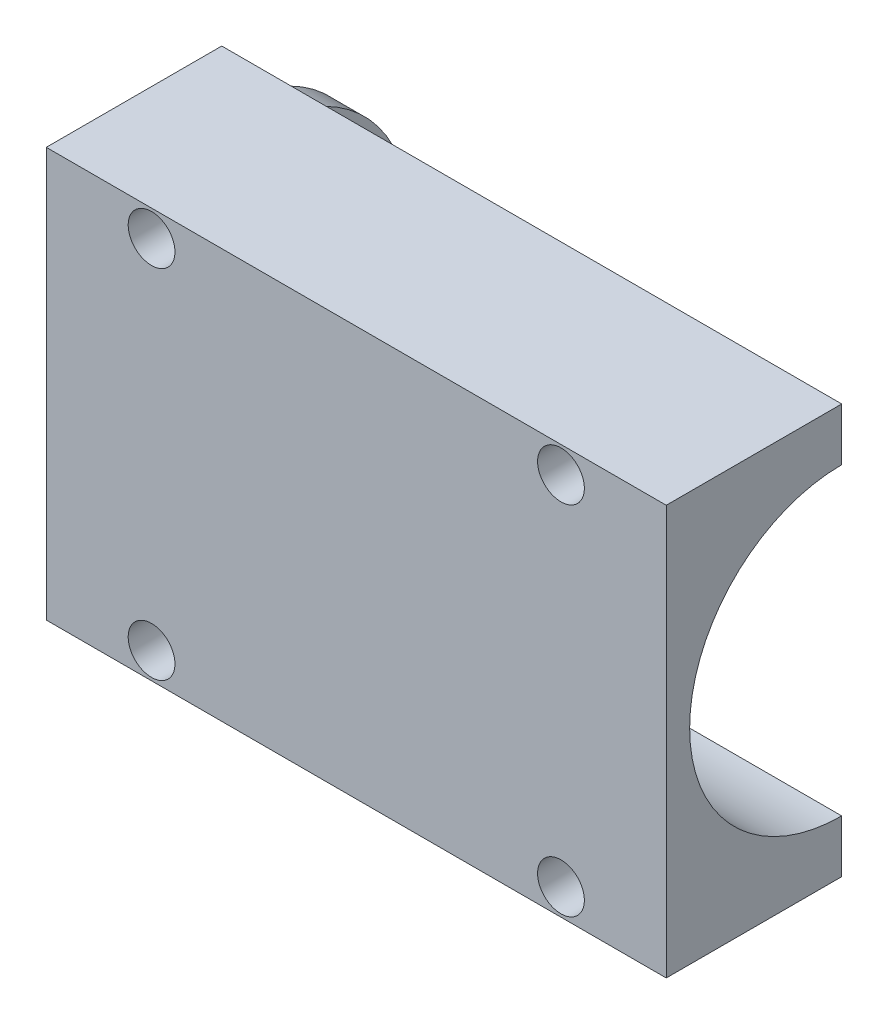
ISO-10303-21;
HEADER;
FILE_DESCRIPTION(('STEP AP214'),'2;1');
FILE_NAME('part.step','',(''),(''),'','','');
FILE_SCHEMA(('AUTOMOTIVE_DESIGN { 1 0 10303 214 1 1 1 1 }'));
ENDSEC;
DATA;
#1=APPLICATION_CONTEXT('core data for automotive mechanical design processes');
#2=APPLICATION_PROTOCOL_DEFINITION('international standard','automotive_design',2000,#1);
#3=PRODUCT_CONTEXT('',#1,'mechanical');
#4=PRODUCT('Part','Part','',(#3));
#5=PRODUCT_RELATED_PRODUCT_CATEGORY('part','',(#4));
#6=PRODUCT_DEFINITION_FORMATION('','',#4);
#7=PRODUCT_DEFINITION_CONTEXT('part definition',#1,'design');
#8=PRODUCT_DEFINITION('design','',#6,#7);
#9=PRODUCT_DEFINITION_SHAPE('','',#8);
#10=(LENGTH_UNIT() NAMED_UNIT(*) SI_UNIT(.MILLI.,.METRE.));
#11=(NAMED_UNIT(*) PLANE_ANGLE_UNIT() SI_UNIT($,.RADIAN.));
#12=(NAMED_UNIT(*) SI_UNIT($,.STERADIAN.) SOLID_ANGLE_UNIT());
#13=UNCERTAINTY_MEASURE_WITH_UNIT(LENGTH_MEASURE(1.E-05),#10,'distance_accuracy_value','');
#14=(GEOMETRIC_REPRESENTATION_CONTEXT(3) GLOBAL_UNCERTAINTY_ASSIGNED_CONTEXT((#13)) GLOBAL_UNIT_ASSIGNED_CONTEXT((#10,
#11,#12)) REPRESENTATION_CONTEXT('',''));
#15=CARTESIAN_POINT('',(0.,0.,0.));
#16=DIRECTION('',(0.,0.,1.));
#17=DIRECTION('',(1.,0.,0.));
#18=AXIS2_PLACEMENT_3D('',#15,#16,#17);
#19=CARTESIAN_POINT('',(0.,0.,0.));
#20=DIRECTION('',(0.,0.,-1.));
#21=DIRECTION('',(-1.,0.,0.));
#22=AXIS2_PLACEMENT_3D('',#19,#20,#21);
#23=PLANE('',#22);
#24=CARTESIAN_POINT('',(17.5,-15.25,0.));
#25=DIRECTION('',(0.,0.,-1.));
#26=DIRECTION('',(-1.,0.,0.));
#27=AXIS2_PLACEMENT_3D('',#24,#25,#26);
#28=CIRCLE('',#27,2.);
#29=CARTESIAN_POINT('',(15.5,-15.25,0.));
#30=VERTEX_POINT('',#29);
#31=EDGE_CURVE('E321',#30,#30,#28,.T.);
#32=ORIENTED_EDGE('',*,*,#31,.F.);
#33=EDGE_LOOP('',(#32));
#34=FACE_BOUND('',#33,.T.);
#35=CARTESIAN_POINT('',(-17.5,-15.25,0.));
#36=DIRECTION('',(0.,0.,-1.));
#37=DIRECTION('',(-1.,0.,0.));
#38=AXIS2_PLACEMENT_3D('',#35,#36,#37);
#39=CIRCLE('',#38,2.);
#40=CARTESIAN_POINT('',(-19.5,-15.25,0.));
#41=VERTEX_POINT('',#40);
#42=EDGE_CURVE('E313',#41,#41,#39,.T.);
#43=ORIENTED_EDGE('',*,*,#42,.F.);
#44=EDGE_LOOP('',(#43));
#45=FACE_BOUND('',#44,.T.);
#46=DIRECTION('',(-1.,0.,0.));
#47=VECTOR('',#46,1.);
#48=CARTESIAN_POINT('',(-23.5,-13.,0.));
#49=LINE('',#48,#47);
#50=CARTESIAN_POINT('',(-23.5,-13.,0.));
#51=VERTEX_POINT('',#50);
#52=CARTESIAN_POINT('',(-26.5,-13.,0.));
#53=VERTEX_POINT('',#52);
#54=EDGE_CURVE('E121',#51,#53,#49,.T.);
#55=ORIENTED_EDGE('',*,*,#54,.F.);
#56=DIRECTION('',(1.,0.,0.));
#57=VECTOR('',#56,1.);
#58=CARTESIAN_POINT('',(-23.5,-13.,0.));
#59=LINE('',#58,#57);
#60=CARTESIAN_POINT('',(26.5,-13.,0.));
#61=VERTEX_POINT('',#60);
#62=EDGE_CURVE('E53',#61,#51,#59,.F.);
#63=ORIENTED_EDGE('',*,*,#62,.F.);
#64=DIRECTION('',(0.,1.,0.));
#65=VECTOR('',#64,1.);
#66=CARTESIAN_POINT('',(26.5,-17.5,0.));
#67=LINE('',#66,#65);
#68=CARTESIAN_POINT('',(26.5,-17.5,0.));
#69=VERTEX_POINT('',#68);
#70=EDGE_CURVE('E146',#69,#61,#67,.T.);
#71=ORIENTED_EDGE('',*,*,#70,.F.);
#72=DIRECTION('',(1.,0.,0.));
#73=VECTOR('',#72,1.);
#74=CARTESIAN_POINT('',(-26.5,-17.5,0.));
#75=LINE('',#74,#73);
#76=CARTESIAN_POINT('',(-26.5,-17.5,0.));
#77=VERTEX_POINT('',#76);
#78=EDGE_CURVE('E89',#77,#69,#75,.T.);
#79=ORIENTED_EDGE('',*,*,#78,.F.);
#80=DIRECTION('',(0.,-1.,0.));
#81=VECTOR('',#80,1.);
#82=CARTESIAN_POINT('',(-26.5,-17.5,0.));
#83=LINE('',#82,#81);
#84=EDGE_CURVE('E155',#53,#77,#83,.T.);
#85=ORIENTED_EDGE('',*,*,#84,.F.);
#86=EDGE_LOOP('',(#55,#63,#71,#79,#85));
#87=FACE_BOUND('',#86,.T.);
#88=ADVANCED_FACE('F43',(#34,#45,#87),#23,.T.);
#89=CARTESIAN_POINT('',(26.5,-17.5,15.));
#90=DIRECTION('',(-1.,0.,0.));
#91=DIRECTION('',(0.,0.,1.));
#92=AXIS2_PLACEMENT_3D('',#89,#90,#91);
#93=PLANE('',#92);
#94=ORIENTED_EDGE('',*,*,#70,.T.);
#95=CARTESIAN_POINT('',(26.5,0.,0.));
#96=DIRECTION('',(1.,0.,0.));
#97=DIRECTION('',(0.,0.,-1.));
#98=AXIS2_PLACEMENT_3D('',#95,#96,#97);
#99=CIRCLE('',#98,13.);
#100=CARTESIAN_POINT('',(26.5,13.,0.));
#101=VERTEX_POINT('',#100);
#102=EDGE_CURVE('E137',#101,#61,#99,.T.);
#103=ORIENTED_EDGE('',*,*,#102,.F.);
#104=CARTESIAN_POINT('',(26.5,17.5,0.));
#105=VERTEX_POINT('',#104);
#106=EDGE_CURVE('E136',#101,#105,#67,.T.);
#107=ORIENTED_EDGE('',*,*,#106,.T.);
#108=DIRECTION('',(0.,0.,-1.));
#109=VECTOR('',#108,1.);
#110=CARTESIAN_POINT('',(26.5,17.5,15.));
#111=LINE('',#110,#109);
#112=CARTESIAN_POINT('',(26.5,17.5,15.));
#113=VERTEX_POINT('',#112);
#114=EDGE_CURVE('E172',#113,#105,#111,.T.);
#115=ORIENTED_EDGE('',*,*,#114,.F.);
#116=DIRECTION('',(0.,1.,0.));
#117=VECTOR('',#116,1.);
#118=CARTESIAN_POINT('',(26.5,-17.5,15.));
#119=LINE('',#118,#117);
#120=CARTESIAN_POINT('',(26.5,-17.5,15.));
#121=VERTEX_POINT('',#120);
#122=EDGE_CURVE('E161',#121,#113,#119,.T.);
#123=ORIENTED_EDGE('',*,*,#122,.F.);
#124=DIRECTION('',(0.,0.,-1.));
#125=VECTOR('',#124,1.);
#126=CARTESIAN_POINT('',(26.5,-17.5,15.));
#127=LINE('',#126,#125);
#128=EDGE_CURVE('E162',#121,#69,#127,.T.);
#129=ORIENTED_EDGE('',*,*,#128,.T.);
#130=EDGE_LOOP('',(#94,#103,#107,#115,#123,#129));
#131=FACE_BOUND('',#130,.T.);
#132=ADVANCED_FACE('F45',(#131),#93,.F.);
#133=CARTESIAN_POINT('',(-26.5,17.5,15.));
#134=DIRECTION('',(0.,-1.,0.));
#135=DIRECTION('',(0.,0.,-1.));
#136=AXIS2_PLACEMENT_3D('',#133,#134,#135);
#137=PLANE('',#136);
#138=DIRECTION('',(-1.,0.,0.));
#139=VECTOR('',#138,1.);
#140=CARTESIAN_POINT('',(-26.5,17.5,0.));
#141=LINE('',#140,#139);
#142=CARTESIAN_POINT('',(-26.5,17.5,0.));
#143=VERTEX_POINT('',#142);
#144=EDGE_CURVE('E142',#105,#143,#141,.T.);
#145=ORIENTED_EDGE('',*,*,#144,.T.);
#146=DIRECTION('',(0.,0.,-1.));
#147=VECTOR('',#146,1.);
#148=CARTESIAN_POINT('',(-26.5,17.5,15.));
#149=LINE('',#148,#147);
#150=CARTESIAN_POINT('',(-26.5,17.5,15.));
#151=VERTEX_POINT('',#150);
#152=EDGE_CURVE('E168',#151,#143,#149,.T.);
#153=ORIENTED_EDGE('',*,*,#152,.F.);
#154=DIRECTION('',(-1.,0.,0.));
#155=VECTOR('',#154,1.);
#156=CARTESIAN_POINT('',(-26.5,17.5,15.));
#157=LINE('',#156,#155);
#158=EDGE_CURVE('E97',#113,#151,#157,.T.);
#159=ORIENTED_EDGE('',*,*,#158,.F.);
#160=ORIENTED_EDGE('',*,*,#114,.T.);
#161=EDGE_LOOP('',(#145,#153,#159,#160));
#162=FACE_BOUND('',#161,.T.);
#163=ADVANCED_FACE('F193',(#162),#137,.F.);
#164=CARTESIAN_POINT('',(-26.5,-17.5,15.));
#165=DIRECTION('',(1.,0.,0.));
#166=DIRECTION('',(0.,0.,-1.));
#167=AXIS2_PLACEMENT_3D('',#164,#165,#166);
#168=PLANE('',#167);
#169=CARTESIAN_POINT('',(-26.5,-8.5,0.));
#170=DIRECTION('',(1.,0.,0.));
#171=DIRECTION('',(0.,0.,-1.));
#172=AXIS2_PLACEMENT_3D('',#169,#170,#171);
#173=CIRCLE('',#172,1.75);
#174=CARTESIAN_POINT('',(-26.5,-8.5,-1.75));
#175=VERTEX_POINT('',#174);
#176=EDGE_CURVE('E293',#175,#175,#173,.T.);
#177=ORIENTED_EDGE('',*,*,#176,.T.);
#178=EDGE_LOOP('',(#177));
#179=FACE_BOUND('',#178,.T.);
#180=CARTESIAN_POINT('',(-26.5,8.5,0.));
#181=DIRECTION('',(1.,0.,0.));
#182=DIRECTION('',(0.,0.,-1.));
#183=AXIS2_PLACEMENT_3D('',#180,#181,#182);
#184=CIRCLE('',#183,1.75);
#185=CARTESIAN_POINT('',(-26.5,8.5,-1.75));
#186=VERTEX_POINT('',#185);
#187=EDGE_CURVE('E304',#186,#186,#184,.T.);
#188=ORIENTED_EDGE('',*,*,#187,.T.);
#189=EDGE_LOOP('',(#188));
#190=FACE_BOUND('',#189,.T.);
#191=CARTESIAN_POINT('',(-26.5,0.,0.));
#192=DIRECTION('',(-1.,0.,0.));
#193=DIRECTION('',(0.,0.,1.));
#194=AXIS2_PLACEMENT_3D('',#191,#192,#193);
#195=CIRCLE('',#194,4.5);
#196=CARTESIAN_POINT('',(-26.5,0.,4.5));
#197=VERTEX_POINT('',#196);
#198=EDGE_CURVE('E232',#197,#197,#195,.T.);
#199=ORIENTED_EDGE('',*,*,#198,.F.);
#200=EDGE_LOOP('',(#199));
#201=FACE_BOUND('',#200,.T.);
#202=CARTESIAN_POINT('',(-26.5,13.,0.));
#203=VERTEX_POINT('',#202);
#204=EDGE_CURVE('E156',#143,#203,#83,.T.);
#205=ORIENTED_EDGE('',*,*,#204,.T.);
#206=CARTESIAN_POINT('',(-26.5,0.,0.));
#207=DIRECTION('',(-1.,0.,0.));
#208=DIRECTION('',(0.,0.,1.));
#209=AXIS2_PLACEMENT_3D('',#206,#207,#208);
#210=CIRCLE('',#209,13.);
#211=EDGE_CURVE('E60',#203,#53,#210,.T.);
#212=ORIENTED_EDGE('',*,*,#211,.T.);
#213=ORIENTED_EDGE('',*,*,#84,.T.);
#214=DIRECTION('',(0.,0.,-1.));
#215=VECTOR('',#214,1.);
#216=CARTESIAN_POINT('',(-26.5,-17.5,15.));
#217=LINE('',#216,#215);
#218=CARTESIAN_POINT('',(-26.5,-17.5,15.));
#219=VERTEX_POINT('',#218);
#220=EDGE_CURVE('E165',#219,#77,#217,.T.);
#221=ORIENTED_EDGE('',*,*,#220,.F.);
#222=DIRECTION('',(0.,-1.,0.));
#223=VECTOR('',#222,1.);
#224=CARTESIAN_POINT('',(-26.5,-17.5,15.));
#225=LINE('',#224,#223);
#226=EDGE_CURVE('E178',#151,#219,#225,.T.);
#227=ORIENTED_EDGE('',*,*,#226,.F.);
#228=ORIENTED_EDGE('',*,*,#152,.T.);
#229=EDGE_LOOP('',(#205,#212,#213,#221,#227,#228));
#230=FACE_BOUND('',#229,.T.);
#231=ADVANCED_FACE('F186',(#179,#190,#201,#230),#168,.F.);
#232=CARTESIAN_POINT('',(-26.5,-17.5,15.));
#233=DIRECTION('',(0.,1.,0.));
#234=DIRECTION('',(0.,0.,1.));
#235=AXIS2_PLACEMENT_3D('',#232,#233,#234);
#236=PLANE('',#235);
#237=ORIENTED_EDGE('',*,*,#78,.T.);
#238=ORIENTED_EDGE('',*,*,#128,.F.);
#239=DIRECTION('',(1.,0.,0.));
#240=VECTOR('',#239,1.);
#241=CARTESIAN_POINT('',(-26.5,-17.5,15.));
#242=LINE('',#241,#240);
#243=EDGE_CURVE('E69',#219,#121,#242,.T.);
#244=ORIENTED_EDGE('',*,*,#243,.F.);
#245=ORIENTED_EDGE('',*,*,#220,.T.);
#246=EDGE_LOOP('',(#237,#238,#244,#245));
#247=FACE_BOUND('',#246,.T.);
#248=ADVANCED_FACE('F189',(#247),#236,.F.);
#249=CARTESIAN_POINT('',(0.,0.,15.));
#250=DIRECTION('',(0.,0.,-1.));
#251=DIRECTION('',(-1.,0.,0.));
#252=AXIS2_PLACEMENT_3D('',#249,#250,#251);
#253=PLANE('',#252);
#254=CARTESIAN_POINT('',(17.5,-15.25,15.));
#255=DIRECTION('',(0.,0.,-1.));
#256=DIRECTION('',(-1.,0.,0.));
#257=AXIS2_PLACEMENT_3D('',#254,#255,#256);
#258=CIRCLE('',#257,2.);
#259=CARTESIAN_POINT('',(15.5,-15.25,15.));
#260=VERTEX_POINT('',#259);
#261=EDGE_CURVE('E301',#260,#260,#258,.T.);
#262=ORIENTED_EDGE('',*,*,#261,.T.);
#263=EDGE_LOOP('',(#262));
#264=FACE_BOUND('',#263,.T.);
#265=CARTESIAN_POINT('',(-17.5,-15.25,15.));
#266=DIRECTION('',(0.,0.,-1.));
#267=DIRECTION('',(-1.,0.,0.));
#268=AXIS2_PLACEMENT_3D('',#265,#266,#267);
#269=CIRCLE('',#268,2.);
#270=CARTESIAN_POINT('',(-19.5,-15.25,15.));
#271=VERTEX_POINT('',#270);
#272=EDGE_CURVE('E317',#271,#271,#269,.T.);
#273=ORIENTED_EDGE('',*,*,#272,.T.);
#274=EDGE_LOOP('',(#273));
#275=FACE_BOUND('',#274,.T.);
#276=CARTESIAN_POINT('',(-17.5,15.25,15.));
#277=DIRECTION('',(0.,0.,-1.));
#278=DIRECTION('',(-1.,0.,0.));
#279=AXIS2_PLACEMENT_3D('',#276,#277,#278);
#280=CIRCLE('',#279,2.);
#281=CARTESIAN_POINT('',(-19.5,15.25,15.));
#282=VERTEX_POINT('',#281);
#283=EDGE_CURVE('E234',#282,#282,#280,.T.);
#284=ORIENTED_EDGE('',*,*,#283,.T.);
#285=EDGE_LOOP('',(#284));
#286=FACE_BOUND('',#285,.T.);
#287=CARTESIAN_POINT('',(17.5,15.25,15.));
#288=DIRECTION('',(0.,0.,-1.));
#289=DIRECTION('',(-1.,0.,0.));
#290=AXIS2_PLACEMENT_3D('',#287,#288,#289);
#291=CIRCLE('',#290,2.);
#292=CARTESIAN_POINT('',(15.5,15.25,15.));
#293=VERTEX_POINT('',#292);
#294=EDGE_CURVE('E227',#293,#293,#291,.T.);
#295=ORIENTED_EDGE('',*,*,#294,.T.);
#296=EDGE_LOOP('',(#295));
#297=FACE_BOUND('',#296,.T.);
#298=ORIENTED_EDGE('',*,*,#122,.T.);
#299=ORIENTED_EDGE('',*,*,#158,.T.);
#300=ORIENTED_EDGE('',*,*,#226,.T.);
#301=ORIENTED_EDGE('',*,*,#243,.T.);
#302=EDGE_LOOP('',(#298,#299,#300,#301));
#303=FACE_BOUND('',#302,.T.);
#304=ADVANCED_FACE('F192',(#264,#275,#286,#297,#303),#253,.F.);
#305=CARTESIAN_POINT('',(-17.5,15.25,0.));
#306=DIRECTION('',(0.,0.,-1.));
#307=DIRECTION('',(-1.,0.,0.));
#308=AXIS2_PLACEMENT_3D('',#305,#306,#307);
#309=CIRCLE('',#308,2.);
#310=CARTESIAN_POINT('',(-19.5,15.25,0.));
#311=VERTEX_POINT('',#310);
#312=EDGE_CURVE('E221',#311,#311,#309,.T.);
#313=ORIENTED_EDGE('',*,*,#312,.F.);
#314=EDGE_LOOP('',(#313));
#315=FACE_BOUND('',#314,.T.);
#316=CARTESIAN_POINT('',(17.5,15.25,0.));
#317=DIRECTION('',(0.,0.,-1.));
#318=DIRECTION('',(-1.,0.,0.));
#319=AXIS2_PLACEMENT_3D('',#316,#317,#318);
#320=CIRCLE('',#319,2.);
#321=CARTESIAN_POINT('',(15.5,15.25,0.));
#322=VERTEX_POINT('',#321);
#323=EDGE_CURVE('E224',#322,#322,#320,.T.);
#324=ORIENTED_EDGE('',*,*,#323,.F.);
#325=EDGE_LOOP('',(#324));
#326=FACE_BOUND('',#325,.T.);
#327=DIRECTION('',(-1.,0.,0.));
#328=VECTOR('',#327,1.);
#329=CARTESIAN_POINT('',(-23.5,13.,0.));
#330=LINE('',#329,#328);
#331=CARTESIAN_POINT('',(-23.5,13.,0.));
#332=VERTEX_POINT('',#331);
#333=EDGE_CURVE('E112',#203,#332,#330,.F.);
#334=ORIENTED_EDGE('',*,*,#333,.F.);
#335=ORIENTED_EDGE('',*,*,#204,.F.);
#336=ORIENTED_EDGE('',*,*,#144,.F.);
#337=ORIENTED_EDGE('',*,*,#106,.F.);
#338=DIRECTION('',(1.,0.,0.));
#339=VECTOR('',#338,1.);
#340=CARTESIAN_POINT('',(-23.5,13.,0.));
#341=LINE('',#340,#339);
#342=EDGE_CURVE('E11',#332,#101,#341,.T.);
#343=ORIENTED_EDGE('',*,*,#342,.F.);
#344=EDGE_LOOP('',(#334,#335,#336,#337,#343));
#345=FACE_BOUND('',#344,.T.);
#346=ADVANCED_FACE('F140',(#315,#326,#345),#23,.T.);
#347=CARTESIAN_POINT('',(-23.5,0.,0.));
#348=DIRECTION('',(1.,0.,0.));
#349=DIRECTION('',(0.,0.,-1.));
#350=AXIS2_PLACEMENT_3D('',#347,#348,#349);
#351=CYLINDRICAL_SURFACE('',#350,13.);
#352=ORIENTED_EDGE('',*,*,#342,.T.);
#353=ORIENTED_EDGE('',*,*,#102,.T.);
#354=ORIENTED_EDGE('',*,*,#62,.T.);
#355=CARTESIAN_POINT('',(-23.5,0.,0.));
#356=DIRECTION('',(1.,0.,0.));
#357=DIRECTION('',(0.,0.,-1.));
#358=AXIS2_PLACEMENT_3D('',#355,#356,#357);
#359=CIRCLE('',#358,13.);
#360=EDGE_CURVE('E127',#332,#51,#359,.T.);
#361=ORIENTED_EDGE('',*,*,#360,.F.);
#362=EDGE_LOOP('',(#352,#353,#354,#361));
#363=FACE_BOUND('',#362,.T.);
#364=ADVANCED_FACE('F132',(#363),#351,.F.);
#365=CARTESIAN_POINT('',(-23.5,0.,0.));
#366=DIRECTION('',(1.,0.,0.));
#367=DIRECTION('',(0.,0.,-1.));
#368=AXIS2_PLACEMENT_3D('',#365,#366,#367);
#369=PLANE('',#368);
#370=CARTESIAN_POINT('',(-23.5,-8.5,0.));
#371=DIRECTION('',(1.,0.,0.));
#372=DIRECTION('',(0.,0.,-1.));
#373=AXIS2_PLACEMENT_3D('',#370,#371,#372);
#374=CIRCLE('',#373,1.75);
#375=CARTESIAN_POINT('',(-23.5,-8.5,-1.75));
#376=VERTEX_POINT('',#375);
#377=EDGE_CURVE('E295',#376,#376,#374,.T.);
#378=ORIENTED_EDGE('',*,*,#377,.F.);
#379=EDGE_LOOP('',(#378));
#380=FACE_BOUND('',#379,.T.);
#381=CARTESIAN_POINT('',(-23.5,8.5,0.));
#382=DIRECTION('',(1.,0.,0.));
#383=DIRECTION('',(0.,0.,-1.));
#384=AXIS2_PLACEMENT_3D('',#381,#382,#383);
#385=CIRCLE('',#384,1.75);
#386=CARTESIAN_POINT('',(-23.5,8.5,-1.75));
#387=VERTEX_POINT('',#386);
#388=EDGE_CURVE('E297',#387,#387,#385,.T.);
#389=ORIENTED_EDGE('',*,*,#388,.F.);
#390=EDGE_LOOP('',(#389));
#391=FACE_BOUND('',#390,.T.);
#392=CARTESIAN_POINT('',(-23.5,0.,0.));
#393=DIRECTION('',(1.,0.,0.));
#394=DIRECTION('',(0.,0.,-1.));
#395=AXIS2_PLACEMENT_3D('',#392,#393,#394);
#396=CIRCLE('',#395,4.5);
#397=CARTESIAN_POINT('',(-23.5,0.,-4.5));
#398=VERTEX_POINT('',#397);
#399=EDGE_CURVE('E47',#398,#398,#396,.T.);
#400=ORIENTED_EDGE('',*,*,#399,.F.);
#401=EDGE_LOOP('',(#400));
#402=FACE_BOUND('',#401,.T.);
#403=ORIENTED_EDGE('',*,*,#360,.T.);
#404=CARTESIAN_POINT('',(-23.5,0.,0.));
#405=DIRECTION('',(-1.,0.,0.));
#406=DIRECTION('',(0.,0.,1.));
#407=AXIS2_PLACEMENT_3D('',#404,#405,#406);
#408=CIRCLE('',#407,13.);
#409=EDGE_CURVE('E115',#332,#51,#408,.T.);
#410=ORIENTED_EDGE('',*,*,#409,.F.);
#411=EDGE_LOOP('',(#403,#410));
#412=FACE_BOUND('',#411,.T.);
#413=ADVANCED_FACE('F126',(#380,#391,#402,#412),#369,.T.);
#414=CARTESIAN_POINT('',(-23.5,0.,0.));
#415=DIRECTION('',(-1.,0.,0.));
#416=DIRECTION('',(0.,0.,1.));
#417=AXIS2_PLACEMENT_3D('',#414,#415,#416);
#418=CYLINDRICAL_SURFACE('',#417,13.);
#419=ORIENTED_EDGE('',*,*,#409,.T.);
#420=ORIENTED_EDGE('',*,*,#54,.T.);
#421=ORIENTED_EDGE('',*,*,#211,.F.);
#422=ORIENTED_EDGE('',*,*,#333,.T.);
#423=EDGE_LOOP('',(#419,#420,#421,#422));
#424=FACE_BOUND('',#423,.T.);
#425=ADVANCED_FACE('F114',(#424),#418,.T.);
#426=CARTESIAN_POINT('',(26.5,0.,0.));
#427=DIRECTION('',(-1.,0.,0.));
#428=DIRECTION('',(0.,0.,1.));
#429=AXIS2_PLACEMENT_3D('',#426,#427,#428);
#430=CYLINDRICAL_SURFACE('',#429,4.5);
#431=ORIENTED_EDGE('',*,*,#399,.T.);
#432=EDGE_LOOP('',(#431));
#433=FACE_BOUND('',#432,.T.);
#434=ORIENTED_EDGE('',*,*,#198,.T.);
#435=EDGE_LOOP('',(#434));
#436=FACE_BOUND('',#435,.T.);
#437=ADVANCED_FACE('F250',(#433,#436),#430,.F.);
#438=CARTESIAN_POINT('',(17.5,15.25,15.));
#439=DIRECTION('',(0.,0.,-1.));
#440=DIRECTION('',(-1.,0.,0.));
#441=AXIS2_PLACEMENT_3D('',#438,#439,#440);
#442=CYLINDRICAL_SURFACE('',#441,2.);
#443=ORIENTED_EDGE('',*,*,#294,.F.);
#444=EDGE_LOOP('',(#443));
#445=FACE_BOUND('',#444,.T.);
#446=ORIENTED_EDGE('',*,*,#323,.T.);
#447=EDGE_LOOP('',(#446));
#448=FACE_BOUND('',#447,.T.);
#449=ADVANCED_FACE('F265',(#445,#448),#442,.F.);
#450=CARTESIAN_POINT('',(-17.5,15.25,15.));
#451=DIRECTION('',(0.,0.,-1.));
#452=DIRECTION('',(-1.,0.,0.));
#453=AXIS2_PLACEMENT_3D('',#450,#451,#452);
#454=CYLINDRICAL_SURFACE('',#453,2.);
#455=ORIENTED_EDGE('',*,*,#283,.F.);
#456=EDGE_LOOP('',(#455));
#457=FACE_BOUND('',#456,.T.);
#458=ORIENTED_EDGE('',*,*,#312,.T.);
#459=EDGE_LOOP('',(#458));
#460=FACE_BOUND('',#459,.T.);
#461=ADVANCED_FACE('F268',(#457,#460),#454,.F.);
#462=CARTESIAN_POINT('',(-17.5,-15.25,15.));
#463=DIRECTION('',(0.,0.,-1.));
#464=DIRECTION('',(-1.,0.,0.));
#465=AXIS2_PLACEMENT_3D('',#462,#463,#464);
#466=CYLINDRICAL_SURFACE('',#465,2.);
#467=ORIENTED_EDGE('',*,*,#272,.F.);
#468=EDGE_LOOP('',(#467));
#469=FACE_BOUND('',#468,.T.);
#470=ORIENTED_EDGE('',*,*,#42,.T.);
#471=EDGE_LOOP('',(#470));
#472=FACE_BOUND('',#471,.T.);
#473=ADVANCED_FACE('F274',(#469,#472),#466,.F.);
#474=CARTESIAN_POINT('',(17.5,-15.25,15.));
#475=DIRECTION('',(0.,0.,-1.));
#476=DIRECTION('',(-1.,0.,0.));
#477=AXIS2_PLACEMENT_3D('',#474,#475,#476);
#478=CYLINDRICAL_SURFACE('',#477,2.);
#479=ORIENTED_EDGE('',*,*,#261,.F.);
#480=EDGE_LOOP('',(#479));
#481=FACE_BOUND('',#480,.T.);
#482=ORIENTED_EDGE('',*,*,#31,.T.);
#483=EDGE_LOOP('',(#482));
#484=FACE_BOUND('',#483,.T.);
#485=ADVANCED_FACE('F270',(#481,#484),#478,.F.);
#486=CARTESIAN_POINT('',(-26.5,8.5,0.));
#487=DIRECTION('',(1.,0.,0.));
#488=DIRECTION('',(0.,0.,-1.));
#489=AXIS2_PLACEMENT_3D('',#486,#487,#488);
#490=CYLINDRICAL_SURFACE('',#489,1.75);
#491=ORIENTED_EDGE('',*,*,#187,.F.);
#492=EDGE_LOOP('',(#491));
#493=FACE_BOUND('',#492,.T.);
#494=ORIENTED_EDGE('',*,*,#388,.T.);
#495=EDGE_LOOP('',(#494));
#496=FACE_BOUND('',#495,.T.);
#497=ADVANCED_FACE('F273',(#493,#496),#490,.F.);
#498=CARTESIAN_POINT('',(-26.5,-8.5,0.));
#499=DIRECTION('',(1.,0.,0.));
#500=DIRECTION('',(0.,0.,-1.));
#501=AXIS2_PLACEMENT_3D('',#498,#499,#500);
#502=CYLINDRICAL_SURFACE('',#501,1.75);
#503=ORIENTED_EDGE('',*,*,#176,.F.);
#504=EDGE_LOOP('',(#503));
#505=FACE_BOUND('',#504,.T.);
#506=ORIENTED_EDGE('',*,*,#377,.T.);
#507=EDGE_LOOP('',(#506));
#508=FACE_BOUND('',#507,.T.);
#509=ADVANCED_FACE('F284',(#505,#508),#502,.F.);
#510=CLOSED_SHELL('',(#88,#132,#163,#231,#248,#304,#346,#364,#413,#425,#437,#449,#461,#473,#485,
#497,#509));
#511=MANIFOLD_SOLID_BREP('B2',#510);
#512=ADVANCED_BREP_SHAPE_REPRESENTATION('',(#18,#511),#14);
#513=SHAPE_DEFINITION_REPRESENTATION(#9,#512);
ENDSEC;
END-ISO-10303-21;
